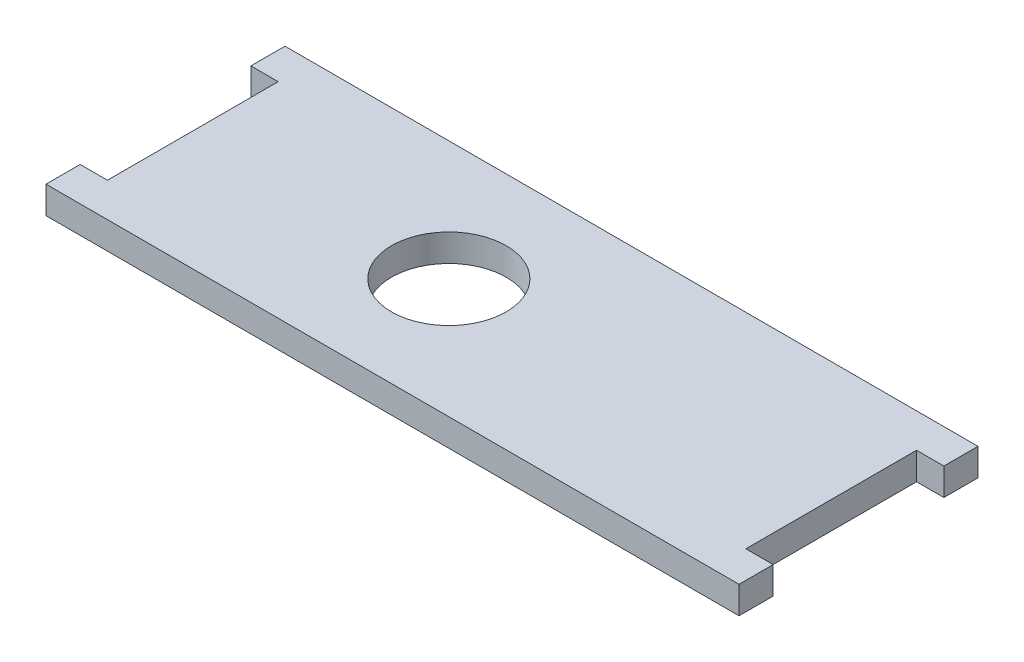
ISO-10303-21;
HEADER;
FILE_DESCRIPTION(('STEP AP214'),'2;1');
FILE_NAME('part.step','',(''),(''),'','','');
FILE_SCHEMA(('AUTOMOTIVE_DESIGN { 1 0 10303 214 1 1 1 1 }'));
ENDSEC;
DATA;
#1=APPLICATION_CONTEXT('core data for automotive mechanical design processes');
#2=APPLICATION_PROTOCOL_DEFINITION('international standard','automotive_design',2000,#1);
#3=PRODUCT_CONTEXT('',#1,'mechanical');
#4=PRODUCT('Part','Part','',(#3));
#5=PRODUCT_RELATED_PRODUCT_CATEGORY('part','',(#4));
#6=PRODUCT_DEFINITION_FORMATION('','',#4);
#7=PRODUCT_DEFINITION_CONTEXT('part definition',#1,'design');
#8=PRODUCT_DEFINITION('design','',#6,#7);
#9=PRODUCT_DEFINITION_SHAPE('','',#8);
#10=(LENGTH_UNIT() NAMED_UNIT(*) SI_UNIT(.MILLI.,.METRE.));
#11=(NAMED_UNIT(*) PLANE_ANGLE_UNIT() SI_UNIT($,.RADIAN.));
#12=(NAMED_UNIT(*) SI_UNIT($,.STERADIAN.) SOLID_ANGLE_UNIT());
#13=UNCERTAINTY_MEASURE_WITH_UNIT(LENGTH_MEASURE(1.E-05),#10,'distance_accuracy_value','');
#14=(GEOMETRIC_REPRESENTATION_CONTEXT(3) GLOBAL_UNCERTAINTY_ASSIGNED_CONTEXT((#13)) GLOBAL_UNIT_ASSIGNED_CONTEXT((#10,
#11,#12)) REPRESENTATION_CONTEXT('',''));
#15=CARTESIAN_POINT('',(0.,0.,0.));
#16=DIRECTION('',(0.,0.,1.));
#17=DIRECTION('',(1.,0.,0.));
#18=AXIS2_PLACEMENT_3D('',#15,#16,#17);
#19=CARTESIAN_POINT('',(-64.4525,5.08,1.40859546249317E-13));
#20=DIRECTION('',(-1.,0.,0.));
#21=DIRECTION('',(0.,0.,1.));
#22=AXIS2_PLACEMENT_3D('',#19,#20,#21);
#23=PLANE('',#22);
#24=DIRECTION('',(0.,0.,-1.));
#25=VECTOR('',#24,1.);
#26=CARTESIAN_POINT('',(-64.4525,0.,1.40859546249317E-13));
#27=LINE('',#26,#25);
#28=CARTESIAN_POINT('',(-64.4525,0.,22.225));
#29=VERTEX_POINT('',#28);
#30=CARTESIAN_POINT('',(-64.4525,0.,15.875));
#31=VERTEX_POINT('',#30);
#32=EDGE_CURVE('E157',#29,#31,#27,.T.);
#33=ORIENTED_EDGE('',*,*,#32,.F.);
#34=DIRECTION('',(0.,-1.,0.));
#35=VECTOR('',#34,1.);
#36=CARTESIAN_POINT('',(-64.4525,5.08,22.225));
#37=LINE('',#36,#35);
#38=CARTESIAN_POINT('',(-64.4525,5.08,22.225));
#39=VERTEX_POINT('',#38);
#40=EDGE_CURVE('E11',#39,#29,#37,.T.);
#41=ORIENTED_EDGE('',*,*,#40,.F.);
#42=DIRECTION('',(0.,0.,-1.));
#43=VECTOR('',#42,1.);
#44=CARTESIAN_POINT('',(-64.4525,5.08,1.40859546249317E-13));
#45=LINE('',#44,#43);
#46=CARTESIAN_POINT('',(-64.4525,5.08,15.875));
#47=VERTEX_POINT('',#46);
#48=EDGE_CURVE('E191',#39,#47,#45,.T.);
#49=ORIENTED_EDGE('',*,*,#48,.T.);
#50=DIRECTION('',(0.,-1.,0.));
#51=VECTOR('',#50,1.);
#52=CARTESIAN_POINT('',(-64.4525,5.08,15.875));
#53=LINE('',#52,#51);
#54=EDGE_CURVE('E97',#47,#31,#53,.T.);
#55=ORIENTED_EDGE('',*,*,#54,.T.);
#56=EDGE_LOOP('',(#33,#41,#49,#55));
#57=FACE_BOUND('',#56,.T.);
#58=ADVANCED_FACE('F35',(#57),#23,.T.);
#59=CARTESIAN_POINT('',(0.,5.08,22.225));
#60=DIRECTION('',(0.,0.,1.));
#61=DIRECTION('',(1.,0.,0.));
#62=AXIS2_PLACEMENT_3D('',#59,#60,#61);
#63=PLANE('',#62);
#64=DIRECTION('',(-1.,0.,0.));
#65=VECTOR('',#64,1.);
#66=CARTESIAN_POINT('',(0.,0.,22.225));
#67=LINE('',#66,#65);
#68=CARTESIAN_POINT('',(64.4525,0.,22.225));
#69=VERTEX_POINT('',#68);
#70=EDGE_CURVE('E160',#69,#29,#67,.T.);
#71=ORIENTED_EDGE('',*,*,#70,.F.);
#72=DIRECTION('',(0.,-1.,0.));
#73=VECTOR('',#72,1.);
#74=CARTESIAN_POINT('',(64.4525,5.08,22.225));
#75=LINE('',#74,#73);
#76=CARTESIAN_POINT('',(64.4525,5.08,22.225));
#77=VERTEX_POINT('',#76);
#78=EDGE_CURVE('E43',#77,#69,#75,.T.);
#79=ORIENTED_EDGE('',*,*,#78,.F.);
#80=DIRECTION('',(-1.,0.,0.));
#81=VECTOR('',#80,1.);
#82=CARTESIAN_POINT('',(0.,5.08,22.225));
#83=LINE('',#82,#81);
#84=EDGE_CURVE('E221',#77,#39,#83,.T.);
#85=ORIENTED_EDGE('',*,*,#84,.T.);
#86=ORIENTED_EDGE('',*,*,#40,.T.);
#87=EDGE_LOOP('',(#71,#79,#85,#86));
#88=FACE_BOUND('',#87,.T.);
#89=ADVANCED_FACE('F220',(#88),#63,.T.);
#90=CARTESIAN_POINT('',(64.4525,5.08,0.));
#91=DIRECTION('',(-1.,0.,0.));
#92=DIRECTION('',(0.,0.,1.));
#93=AXIS2_PLACEMENT_3D('',#90,#91,#92);
#94=PLANE('',#93);
#95=DIRECTION('',(0.,0.,-1.));
#96=VECTOR('',#95,1.);
#97=CARTESIAN_POINT('',(64.4525,0.,0.));
#98=LINE('',#97,#96);
#99=CARTESIAN_POINT('',(64.4525,0.,15.875));
#100=VERTEX_POINT('',#99);
#101=EDGE_CURVE('E163',#69,#100,#98,.T.);
#102=ORIENTED_EDGE('',*,*,#101,.T.);
#103=DIRECTION('',(0.,-1.,0.));
#104=VECTOR('',#103,1.);
#105=CARTESIAN_POINT('',(64.4525,5.08,15.875));
#106=LINE('',#105,#104);
#107=CARTESIAN_POINT('',(64.4525,5.08,15.875));
#108=VERTEX_POINT('',#107);
#109=EDGE_CURVE('E205',#108,#100,#106,.T.);
#110=ORIENTED_EDGE('',*,*,#109,.F.);
#111=DIRECTION('',(0.,0.,-1.));
#112=VECTOR('',#111,1.);
#113=CARTESIAN_POINT('',(64.4525,5.08,0.));
#114=LINE('',#113,#112);
#115=EDGE_CURVE('E211',#77,#108,#114,.T.);
#116=ORIENTED_EDGE('',*,*,#115,.F.);
#117=ORIENTED_EDGE('',*,*,#78,.T.);
#118=EDGE_LOOP('',(#102,#110,#116,#117));
#119=FACE_BOUND('',#118,.T.);
#120=ADVANCED_FACE('F209',(#119),#94,.F.);
#121=CARTESIAN_POINT('',(0.,5.08,15.875));
#122=DIRECTION('',(0.,0.,-1.));
#123=DIRECTION('',(-1.,0.,0.));
#124=AXIS2_PLACEMENT_3D('',#121,#122,#123);
#125=PLANE('',#124);
#126=DIRECTION('',(1.,0.,0.));
#127=VECTOR('',#126,1.);
#128=CARTESIAN_POINT('',(0.,0.,15.875));
#129=LINE('',#128,#127);
#130=CARTESIAN_POINT('',(59.3725,0.,15.875));
#131=VERTEX_POINT('',#130);
#132=EDGE_CURVE('E166',#131,#100,#129,.T.);
#133=ORIENTED_EDGE('',*,*,#132,.F.);
#134=DIRECTION('',(0.,-1.,0.));
#135=VECTOR('',#134,1.);
#136=CARTESIAN_POINT('',(59.3725,5.08,15.875));
#137=LINE('',#136,#135);
#138=CARTESIAN_POINT('',(59.3725,5.08,15.875));
#139=VERTEX_POINT('',#138);
#140=EDGE_CURVE('E203',#139,#131,#137,.T.);
#141=ORIENTED_EDGE('',*,*,#140,.F.);
#142=DIRECTION('',(1.,0.,0.));
#143=VECTOR('',#142,1.);
#144=CARTESIAN_POINT('',(0.,5.08,15.875));
#145=LINE('',#144,#143);
#146=EDGE_CURVE('E229',#139,#108,#145,.T.);
#147=ORIENTED_EDGE('',*,*,#146,.T.);
#148=ORIENTED_EDGE('',*,*,#109,.T.);
#149=EDGE_LOOP('',(#133,#141,#147,#148));
#150=FACE_BOUND('',#149,.T.);
#151=ADVANCED_FACE('F269',(#150),#125,.T.);
#152=CARTESIAN_POINT('',(59.3725,5.08,0.));
#153=DIRECTION('',(1.,0.,0.));
#154=DIRECTION('',(0.,0.,-1.));
#155=AXIS2_PLACEMENT_3D('',#152,#153,#154);
#156=PLANE('',#155);
#157=DIRECTION('',(0.,0.,1.));
#158=VECTOR('',#157,1.);
#159=CARTESIAN_POINT('',(59.3725,0.,0.));
#160=LINE('',#159,#158);
#161=CARTESIAN_POINT('',(59.3725,0.,-15.875));
#162=VERTEX_POINT('',#161);
#163=EDGE_CURVE('E169',#162,#131,#160,.T.);
#164=ORIENTED_EDGE('',*,*,#163,.F.);
#165=DIRECTION('',(0.,-1.,0.));
#166=VECTOR('',#165,1.);
#167=CARTESIAN_POINT('',(59.3725,5.08,-15.875));
#168=LINE('',#167,#166);
#169=CARTESIAN_POINT('',(59.3725,5.08,-15.875));
#170=VERTEX_POINT('',#169);
#171=EDGE_CURVE('E201',#170,#162,#168,.T.);
#172=ORIENTED_EDGE('',*,*,#171,.F.);
#173=DIRECTION('',(0.,0.,1.));
#174=VECTOR('',#173,1.);
#175=CARTESIAN_POINT('',(59.3725,5.08,0.));
#176=LINE('',#175,#174);
#177=EDGE_CURVE('E232',#170,#139,#176,.T.);
#178=ORIENTED_EDGE('',*,*,#177,.T.);
#179=ORIENTED_EDGE('',*,*,#140,.T.);
#180=EDGE_LOOP('',(#164,#172,#178,#179));
#181=FACE_BOUND('',#180,.T.);
#182=ADVANCED_FACE('F274',(#181),#156,.T.);
#183=CARTESIAN_POINT('',(0.,5.08,-15.875));
#184=DIRECTION('',(0.,0.,-1.));
#185=DIRECTION('',(-1.,0.,0.));
#186=AXIS2_PLACEMENT_3D('',#183,#184,#185);
#187=PLANE('',#186);
#188=DIRECTION('',(1.,0.,0.));
#189=VECTOR('',#188,1.);
#190=CARTESIAN_POINT('',(0.,0.,-15.875));
#191=LINE('',#190,#189);
#192=CARTESIAN_POINT('',(64.4525,0.,-15.875));
#193=VERTEX_POINT('',#192);
#194=EDGE_CURVE('E172',#162,#193,#191,.T.);
#195=ORIENTED_EDGE('',*,*,#194,.T.);
#196=DIRECTION('',(0.,-1.,0.));
#197=VECTOR('',#196,1.);
#198=CARTESIAN_POINT('',(64.4525,5.08,-15.875));
#199=LINE('',#198,#197);
#200=CARTESIAN_POINT('',(64.4525,5.08,-15.875));
#201=VERTEX_POINT('',#200);
#202=EDGE_CURVE('E199',#201,#193,#199,.T.);
#203=ORIENTED_EDGE('',*,*,#202,.F.);
#204=DIRECTION('',(1.,0.,0.));
#205=VECTOR('',#204,1.);
#206=CARTESIAN_POINT('',(0.,5.08,-15.875));
#207=LINE('',#206,#205);
#208=EDGE_CURVE('E235',#170,#201,#207,.T.);
#209=ORIENTED_EDGE('',*,*,#208,.F.);
#210=ORIENTED_EDGE('',*,*,#171,.T.);
#211=EDGE_LOOP('',(#195,#203,#209,#210));
#212=FACE_BOUND('',#211,.T.);
#213=ADVANCED_FACE('F278',(#212),#187,.F.);
#214=CARTESIAN_POINT('',(64.4525,5.08,0.));
#215=DIRECTION('',(1.,0.,0.));
#216=DIRECTION('',(0.,0.,-1.));
#217=AXIS2_PLACEMENT_3D('',#214,#215,#216);
#218=PLANE('',#217);
#219=DIRECTION('',(0.,0.,1.));
#220=VECTOR('',#219,1.);
#221=CARTESIAN_POINT('',(64.4525,0.,0.));
#222=LINE('',#221,#220);
#223=CARTESIAN_POINT('',(64.4525,0.,-22.225));
#224=VERTEX_POINT('',#223);
#225=EDGE_CURVE('E175',#224,#193,#222,.T.);
#226=ORIENTED_EDGE('',*,*,#225,.F.);
#227=DIRECTION('',(0.,-1.,0.));
#228=VECTOR('',#227,1.);
#229=CARTESIAN_POINT('',(64.4525,5.08,-22.225));
#230=LINE('',#229,#228);
#231=CARTESIAN_POINT('',(64.4525,5.08,-22.225));
#232=VERTEX_POINT('',#231);
#233=EDGE_CURVE('E197',#232,#224,#230,.T.);
#234=ORIENTED_EDGE('',*,*,#233,.F.);
#235=DIRECTION('',(0.,0.,1.));
#236=VECTOR('',#235,1.);
#237=CARTESIAN_POINT('',(64.4525,5.08,0.));
#238=LINE('',#237,#236);
#239=EDGE_CURVE('E237',#232,#201,#238,.T.);
#240=ORIENTED_EDGE('',*,*,#239,.T.);
#241=ORIENTED_EDGE('',*,*,#202,.T.);
#242=EDGE_LOOP('',(#226,#234,#240,#241));
#243=FACE_BOUND('',#242,.T.);
#244=ADVANCED_FACE('F249',(#243),#218,.T.);
#245=CARTESIAN_POINT('',(0.,5.08,-22.225));
#246=DIRECTION('',(0.,0.,-1.));
#247=DIRECTION('',(-1.,0.,0.));
#248=AXIS2_PLACEMENT_3D('',#245,#246,#247);
#249=PLANE('',#248);
#250=DIRECTION('',(1.,0.,0.));
#251=VECTOR('',#250,1.);
#252=CARTESIAN_POINT('',(0.,0.,-22.225));
#253=LINE('',#252,#251);
#254=CARTESIAN_POINT('',(-64.4525,0.,-22.225));
#255=VERTEX_POINT('',#254);
#256=EDGE_CURVE('E178',#255,#224,#253,.T.);
#257=ORIENTED_EDGE('',*,*,#256,.F.);
#258=DIRECTION('',(0.,-1.,0.));
#259=VECTOR('',#258,1.);
#260=CARTESIAN_POINT('',(-64.4525,5.08,-22.225));
#261=LINE('',#260,#259);
#262=CARTESIAN_POINT('',(-64.4525,5.08,-22.225));
#263=VERTEX_POINT('',#262);
#264=EDGE_CURVE('E195',#263,#255,#261,.T.);
#265=ORIENTED_EDGE('',*,*,#264,.F.);
#266=DIRECTION('',(1.,0.,0.));
#267=VECTOR('',#266,1.);
#268=CARTESIAN_POINT('',(0.,5.08,-22.225));
#269=LINE('',#268,#267);
#270=EDGE_CURVE('E149',#263,#232,#269,.T.);
#271=ORIENTED_EDGE('',*,*,#270,.T.);
#272=ORIENTED_EDGE('',*,*,#233,.T.);
#273=EDGE_LOOP('',(#257,#265,#271,#272));
#274=FACE_BOUND('',#273,.T.);
#275=ADVANCED_FACE('F242',(#274),#249,.T.);
#276=CARTESIAN_POINT('',(-64.4525,5.08,0.));
#277=DIRECTION('',(1.,0.,0.));
#278=DIRECTION('',(0.,0.,-1.));
#279=AXIS2_PLACEMENT_3D('',#276,#277,#278);
#280=PLANE('',#279);
#281=DIRECTION('',(0.,0.,1.));
#282=VECTOR('',#281,1.);
#283=CARTESIAN_POINT('',(-64.4525,0.,0.));
#284=LINE('',#283,#282);
#285=CARTESIAN_POINT('',(-64.4525,0.,-15.875));
#286=VERTEX_POINT('',#285);
#287=EDGE_CURVE('E181',#255,#286,#284,.T.);
#288=ORIENTED_EDGE('',*,*,#287,.T.);
#289=DIRECTION('',(0.,-1.,0.));
#290=VECTOR('',#289,1.);
#291=CARTESIAN_POINT('',(-64.4525,5.08,-15.875));
#292=LINE('',#291,#290);
#293=CARTESIAN_POINT('',(-64.4525,5.08,-15.875));
#294=VERTEX_POINT('',#293);
#295=EDGE_CURVE('E136',#294,#286,#292,.T.);
#296=ORIENTED_EDGE('',*,*,#295,.F.);
#297=DIRECTION('',(0.,0.,1.));
#298=VECTOR('',#297,1.);
#299=CARTESIAN_POINT('',(-64.4525,5.08,0.));
#300=LINE('',#299,#298);
#301=EDGE_CURVE('E146',#263,#294,#300,.T.);
#302=ORIENTED_EDGE('',*,*,#301,.F.);
#303=ORIENTED_EDGE('',*,*,#264,.T.);
#304=EDGE_LOOP('',(#288,#296,#302,#303));
#305=FACE_BOUND('',#304,.T.);
#306=ADVANCED_FACE('F253',(#305),#280,.F.);
#307=CARTESIAN_POINT('',(0.,5.08,-15.875));
#308=DIRECTION('',(0.,0.,1.));
#309=DIRECTION('',(1.,0.,0.));
#310=AXIS2_PLACEMENT_3D('',#307,#308,#309);
#311=PLANE('',#310);
#312=DIRECTION('',(-1.,0.,0.));
#313=VECTOR('',#312,1.);
#314=CARTESIAN_POINT('',(0.,0.,-15.875));
#315=LINE('',#314,#313);
#316=CARTESIAN_POINT('',(-59.3725,0.,-15.875));
#317=VERTEX_POINT('',#316);
#318=EDGE_CURVE('E135',#317,#286,#315,.T.);
#319=ORIENTED_EDGE('',*,*,#318,.F.);
#320=DIRECTION('',(0.,-1.,0.));
#321=VECTOR('',#320,1.);
#322=CARTESIAN_POINT('',(-59.3725,5.08,-15.875));
#323=LINE('',#322,#321);
#324=CARTESIAN_POINT('',(-59.3725,5.08,-15.875));
#325=VERTEX_POINT('',#324);
#326=EDGE_CURVE('E129',#325,#317,#323,.T.);
#327=ORIENTED_EDGE('',*,*,#326,.F.);
#328=DIRECTION('',(-1.,0.,0.));
#329=VECTOR('',#328,1.);
#330=CARTESIAN_POINT('',(0.,5.08,-15.875));
#331=LINE('',#330,#329);
#332=EDGE_CURVE('E133',#325,#294,#331,.T.);
#333=ORIENTED_EDGE('',*,*,#332,.T.);
#334=ORIENTED_EDGE('',*,*,#295,.T.);
#335=EDGE_LOOP('',(#319,#327,#333,#334));
#336=FACE_BOUND('',#335,.T.);
#337=ADVANCED_FACE('F131',(#336),#311,.T.);
#338=CARTESIAN_POINT('',(-59.3725,5.08,0.));
#339=DIRECTION('',(1.,0.,0.));
#340=DIRECTION('',(0.,0.,-1.));
#341=AXIS2_PLACEMENT_3D('',#338,#339,#340);
#342=PLANE('',#341);
#343=DIRECTION('',(0.,0.,1.));
#344=VECTOR('',#343,1.);
#345=CARTESIAN_POINT('',(-59.3725,0.,0.));
#346=LINE('',#345,#344);
#347=CARTESIAN_POINT('',(-59.3725,0.,15.875));
#348=VERTEX_POINT('',#347);
#349=EDGE_CURVE('E90',#317,#348,#346,.T.);
#350=ORIENTED_EDGE('',*,*,#349,.T.);
#351=DIRECTION('',(0.,-1.,0.));
#352=VECTOR('',#351,1.);
#353=CARTESIAN_POINT('',(-59.3725,5.08,15.875));
#354=LINE('',#353,#352);
#355=CARTESIAN_POINT('',(-59.3725,5.08,15.875));
#356=VERTEX_POINT('',#355);
#357=EDGE_CURVE('E137',#356,#348,#354,.T.);
#358=ORIENTED_EDGE('',*,*,#357,.F.);
#359=DIRECTION('',(0.,0.,1.));
#360=VECTOR('',#359,1.);
#361=CARTESIAN_POINT('',(-59.3725,5.08,0.));
#362=LINE('',#361,#360);
#363=EDGE_CURVE('E139',#325,#356,#362,.T.);
#364=ORIENTED_EDGE('',*,*,#363,.F.);
#365=ORIENTED_EDGE('',*,*,#326,.T.);
#366=EDGE_LOOP('',(#350,#358,#364,#365));
#367=FACE_BOUND('',#366,.T.);
#368=ADVANCED_FACE('F140',(#367),#342,.F.);
#369=CARTESIAN_POINT('',(0.,5.08,15.875));
#370=DIRECTION('',(0.,0.,1.));
#371=DIRECTION('',(1.,0.,0.));
#372=AXIS2_PLACEMENT_3D('',#369,#370,#371);
#373=PLANE('',#372);
#374=DIRECTION('',(-1.,0.,0.));
#375=VECTOR('',#374,1.);
#376=CARTESIAN_POINT('',(0.,0.,15.875));
#377=LINE('',#376,#375);
#378=EDGE_CURVE('E186',#348,#31,#377,.T.);
#379=ORIENTED_EDGE('',*,*,#378,.T.);
#380=ORIENTED_EDGE('',*,*,#54,.F.);
#381=DIRECTION('',(-1.,0.,0.));
#382=VECTOR('',#381,1.);
#383=CARTESIAN_POINT('',(0.,5.08,15.875));
#384=LINE('',#383,#382);
#385=EDGE_CURVE('E51',#356,#47,#384,.T.);
#386=ORIENTED_EDGE('',*,*,#385,.F.);
#387=ORIENTED_EDGE('',*,*,#357,.T.);
#388=EDGE_LOOP('',(#379,#380,#386,#387));
#389=FACE_BOUND('',#388,.T.);
#390=ADVANCED_FACE('F224',(#389),#373,.F.);
#391=CARTESIAN_POINT('',(-11.7475,5.08,0.));
#392=DIRECTION('',(0.,-1.,0.));
#393=DIRECTION('',(0.,0.,-1.));
#394=AXIS2_PLACEMENT_3D('',#391,#392,#393);
#395=CYLINDRICAL_SURFACE('',#394,10.668);
#396=CARTESIAN_POINT('',(-11.7475,5.08,0.));
#397=DIRECTION('',(0.,1.,0.));
#398=DIRECTION('',(0.,0.,1.));
#399=AXIS2_PLACEMENT_3D('',#396,#397,#398);
#400=CIRCLE('',#399,10.668);
#401=CARTESIAN_POINT('',(-11.7475,5.08,10.668));
#402=VERTEX_POINT('',#401);
#403=EDGE_CURVE('E154',#402,#402,#400,.T.);
#404=ORIENTED_EDGE('',*,*,#403,.T.);
#405=EDGE_LOOP('',(#404));
#406=FACE_BOUND('',#405,.T.);
#407=CARTESIAN_POINT('',(-11.7475,0.,0.));
#408=DIRECTION('',(0.,1.,0.));
#409=DIRECTION('',(0.,0.,1.));
#410=AXIS2_PLACEMENT_3D('',#407,#408,#409);
#411=CIRCLE('',#410,10.668);
#412=CARTESIAN_POINT('',(-11.7475,0.,10.668));
#413=VERTEX_POINT('',#412);
#414=EDGE_CURVE('E188',#413,#413,#411,.T.);
#415=ORIENTED_EDGE('',*,*,#414,.F.);
#416=EDGE_LOOP('',(#415));
#417=FACE_BOUND('',#416,.T.);
#418=ADVANCED_FACE('F322',(#406,#417),#395,.F.);
#419=CARTESIAN_POINT('',(0.,5.08,0.));
#420=DIRECTION('',(0.,1.,0.));
#421=DIRECTION('',(0.,0.,1.));
#422=AXIS2_PLACEMENT_3D('',#419,#420,#421);
#423=PLANE('',#422);
#424=ORIENTED_EDGE('',*,*,#48,.F.);
#425=ORIENTED_EDGE('',*,*,#84,.F.);
#426=ORIENTED_EDGE('',*,*,#115,.T.);
#427=ORIENTED_EDGE('',*,*,#146,.F.);
#428=ORIENTED_EDGE('',*,*,#177,.F.);
#429=ORIENTED_EDGE('',*,*,#208,.T.);
#430=ORIENTED_EDGE('',*,*,#239,.F.);
#431=ORIENTED_EDGE('',*,*,#270,.F.);
#432=ORIENTED_EDGE('',*,*,#301,.T.);
#433=ORIENTED_EDGE('',*,*,#332,.F.);
#434=ORIENTED_EDGE('',*,*,#363,.T.);
#435=ORIENTED_EDGE('',*,*,#385,.T.);
#436=EDGE_LOOP('',(#424,#425,#426,#427,#428,#429,#430,#431,#432,#433,#434,#435));
#437=FACE_BOUND('',#436,.T.);
#438=ORIENTED_EDGE('',*,*,#403,.F.);
#439=EDGE_LOOP('',(#438));
#440=FACE_BOUND('',#439,.T.);
#441=ADVANCED_FACE('F142',(#437,#440),#423,.T.);
#442=CARTESIAN_POINT('',(0.,0.,0.));
#443=DIRECTION('',(0.,1.,0.));
#444=DIRECTION('',(0.,0.,1.));
#445=AXIS2_PLACEMENT_3D('',#442,#443,#444);
#446=PLANE('',#445);
#447=ORIENTED_EDGE('',*,*,#32,.T.);
#448=ORIENTED_EDGE('',*,*,#378,.F.);
#449=ORIENTED_EDGE('',*,*,#349,.F.);
#450=ORIENTED_EDGE('',*,*,#318,.T.);
#451=ORIENTED_EDGE('',*,*,#287,.F.);
#452=ORIENTED_EDGE('',*,*,#256,.T.);
#453=ORIENTED_EDGE('',*,*,#225,.T.);
#454=ORIENTED_EDGE('',*,*,#194,.F.);
#455=ORIENTED_EDGE('',*,*,#163,.T.);
#456=ORIENTED_EDGE('',*,*,#132,.T.);
#457=ORIENTED_EDGE('',*,*,#101,.F.);
#458=ORIENTED_EDGE('',*,*,#70,.T.);
#459=EDGE_LOOP('',(#447,#448,#449,#450,#451,#452,#453,#454,#455,#456,#457,#458));
#460=FACE_BOUND('',#459,.T.);
#461=ORIENTED_EDGE('',*,*,#414,.T.);
#462=EDGE_LOOP('',(#461));
#463=FACE_BOUND('',#462,.T.);
#464=ADVANCED_FACE('F217',(#460,#463),#446,.F.);
#465=CLOSED_SHELL('',(#58,#89,#120,#151,#182,#213,#244,#275,#306,#337,#368,#390,#418,#441,#464));
#466=MANIFOLD_SOLID_BREP('B2',#465);
#467=ADVANCED_BREP_SHAPE_REPRESENTATION('',(#18,#466),#14);
#468=SHAPE_DEFINITION_REPRESENTATION(#9,#467);
ENDSEC;
END-ISO-10303-21;
